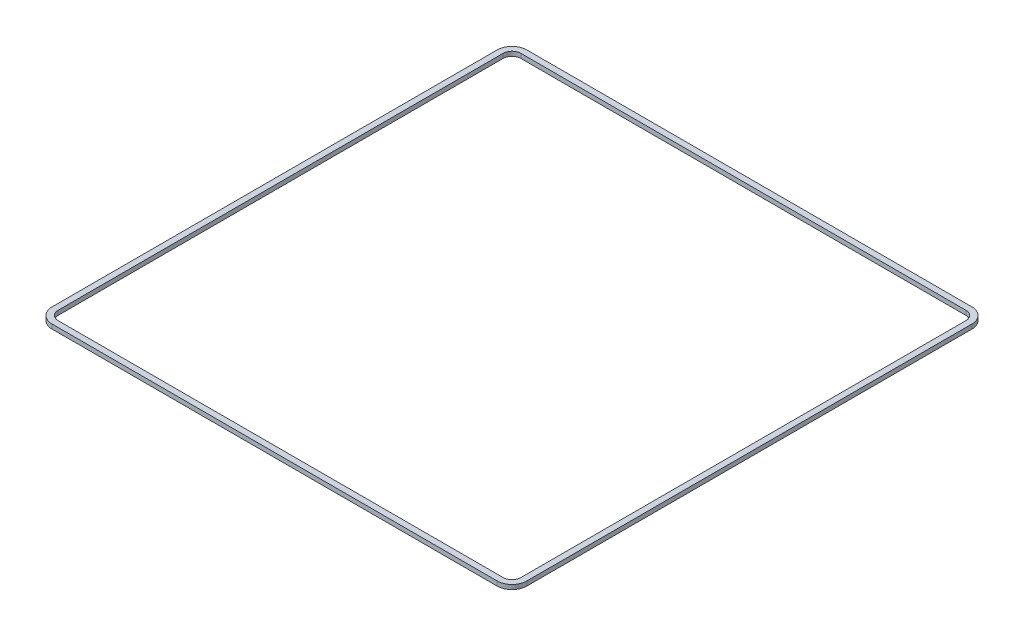
ISO-10303-21;
HEADER;
FILE_DESCRIPTION(('STEP AP214'),'2;1');
FILE_NAME('part.step','',(''),(''),'','','');
FILE_SCHEMA(('AUTOMOTIVE_DESIGN { 1 0 10303 214 1 1 1 1 }'));
ENDSEC;
DATA;
#1=APPLICATION_CONTEXT('core data for automotive mechanical design processes');
#2=APPLICATION_PROTOCOL_DEFINITION('international standard','automotive_design',2000,#1);
#3=PRODUCT_CONTEXT('',#1,'mechanical');
#4=PRODUCT('Part','Part','',(#3));
#5=PRODUCT_RELATED_PRODUCT_CATEGORY('part','',(#4));
#6=PRODUCT_DEFINITION_FORMATION('','',#4);
#7=PRODUCT_DEFINITION_CONTEXT('part definition',#1,'design');
#8=PRODUCT_DEFINITION('design','',#6,#7);
#9=PRODUCT_DEFINITION_SHAPE('','',#8);
#10=(LENGTH_UNIT() NAMED_UNIT(*) SI_UNIT(.MILLI.,.METRE.));
#11=(NAMED_UNIT(*) PLANE_ANGLE_UNIT() SI_UNIT($,.RADIAN.));
#12=(NAMED_UNIT(*) SI_UNIT($,.STERADIAN.) SOLID_ANGLE_UNIT());
#13=UNCERTAINTY_MEASURE_WITH_UNIT(LENGTH_MEASURE(1.E-05),#10,'distance_accuracy_value','');
#14=(GEOMETRIC_REPRESENTATION_CONTEXT(3) GLOBAL_UNCERTAINTY_ASSIGNED_CONTEXT((#13)) GLOBAL_UNIT_ASSIGNED_CONTEXT((#10,
#11,#12)) REPRESENTATION_CONTEXT('',''));
#15=CARTESIAN_POINT('',(0.,0.,0.));
#16=DIRECTION('',(0.,0.,1.));
#17=DIRECTION('',(1.,0.,0.));
#18=AXIS2_PLACEMENT_3D('',#15,#16,#17);
#19=CARTESIAN_POINT('',(0.,3.,0.));
#20=DIRECTION('',(0.,1.,0.));
#21=DIRECTION('',(0.,0.,1.));
#22=AXIS2_PLACEMENT_3D('',#19,#20,#21);
#23=PLANE('',#22);
#24=DIRECTION('',(0.,0.,1.));
#25=VECTOR('',#24,1.);
#26=CARTESIAN_POINT('',(205.2,3.,0.));
#27=LINE('',#26,#25);
#28=CARTESIAN_POINT('',(205.2,3.,-93.57));
#29=VERTEX_POINT('',#28);
#30=CARTESIAN_POINT('',(205.2,3.,206.43));
#31=VERTEX_POINT('',#30);
#32=EDGE_CURVE('E194',#29,#31,#27,.T.);
#33=ORIENTED_EDGE('',*,*,#32,.F.);
#34=CARTESIAN_POINT('',(195.2,3.,-93.57));
#35=DIRECTION('',(0.,1.,0.));
#36=DIRECTION('',(0.,0.,1.));
#37=AXIS2_PLACEMENT_3D('',#34,#35,#36);
#38=CIRCLE('',#37,10.);
#39=CARTESIAN_POINT('',(195.2,3.,-103.57));
#40=VERTEX_POINT('',#39);
#41=EDGE_CURVE('E241',#29,#40,#38,.T.);
#42=ORIENTED_EDGE('',*,*,#41,.T.);
#43=DIRECTION('',(1.,0.,0.));
#44=VECTOR('',#43,1.);
#45=CARTESIAN_POINT('',(0.,3.,-103.57));
#46=LINE('',#45,#44);
#47=CARTESIAN_POINT('',(-104.8,3.,-103.57));
#48=VERTEX_POINT('',#47);
#49=EDGE_CURVE('E197',#48,#40,#46,.T.);
#50=ORIENTED_EDGE('',*,*,#49,.F.);
#51=CARTESIAN_POINT('',(-104.8,3.,-93.57));
#52=DIRECTION('',(0.,1.,0.));
#53=DIRECTION('',(0.,0.,1.));
#54=AXIS2_PLACEMENT_3D('',#51,#52,#53);
#55=CIRCLE('',#54,10.);
#56=CARTESIAN_POINT('',(-114.8,3.,-93.57));
#57=VERTEX_POINT('',#56);
#58=EDGE_CURVE('E239',#48,#57,#55,.T.);
#59=ORIENTED_EDGE('',*,*,#58,.T.);
#60=DIRECTION('',(0.,0.,1.));
#61=VECTOR('',#60,1.);
#62=CARTESIAN_POINT('',(-114.8,3.,0.));
#63=LINE('',#62,#61);
#64=CARTESIAN_POINT('',(-114.8,3.,206.43));
#65=VERTEX_POINT('',#64);
#66=EDGE_CURVE('E201',#57,#65,#63,.T.);
#67=ORIENTED_EDGE('',*,*,#66,.T.);
#68=CARTESIAN_POINT('',(-104.8,3.,206.43));
#69=DIRECTION('',(0.,1.,0.));
#70=DIRECTION('',(0.,0.,1.));
#71=AXIS2_PLACEMENT_3D('',#68,#69,#70);
#72=CIRCLE('',#71,10.);
#73=CARTESIAN_POINT('',(-104.8,3.,216.43));
#74=VERTEX_POINT('',#73);
#75=EDGE_CURVE('E235',#65,#74,#72,.T.);
#76=ORIENTED_EDGE('',*,*,#75,.T.);
#77=DIRECTION('',(1.,0.,0.));
#78=VECTOR('',#77,1.);
#79=CARTESIAN_POINT('',(0.,3.,216.43));
#80=LINE('',#79,#78);
#81=CARTESIAN_POINT('',(195.2,3.,216.43));
#82=VERTEX_POINT('',#81);
#83=EDGE_CURVE('E204',#74,#82,#80,.T.);
#84=ORIENTED_EDGE('',*,*,#83,.T.);
#85=CARTESIAN_POINT('',(195.2,3.,206.43));
#86=DIRECTION('',(0.,1.,0.));
#87=DIRECTION('',(0.,0.,1.));
#88=AXIS2_PLACEMENT_3D('',#85,#86,#87);
#89=CIRCLE('',#88,10.);
#90=EDGE_CURVE('E237',#82,#31,#89,.T.);
#91=ORIENTED_EDGE('',*,*,#90,.T.);
#92=EDGE_LOOP('',(#33,#42,#50,#59,#67,#76,#84,#91));
#93=FACE_BOUND('',#92,.T.);
#94=CARTESIAN_POINT('',(-104.8,3.,-93.57));
#95=DIRECTION('',(0.,1.,0.));
#96=DIRECTION('',(0.,0.,1.));
#97=AXIS2_PLACEMENT_3D('',#94,#95,#96);
#98=CIRCLE('',#97,5.99999999999999);
#99=CARTESIAN_POINT('',(-104.8,3.,-99.57));
#100=VERTEX_POINT('',#99);
#101=CARTESIAN_POINT('',(-110.8,3.,-93.57));
#102=VERTEX_POINT('',#101);
#103=EDGE_CURVE('E158',#100,#102,#98,.T.);
#104=ORIENTED_EDGE('',*,*,#103,.F.);
#105=DIRECTION('',(1.,0.,0.));
#106=VECTOR('',#105,1.);
#107=CARTESIAN_POINT('',(0.,3.,-99.57));
#108=LINE('',#107,#106);
#109=CARTESIAN_POINT('',(195.2,3.,-99.57));
#110=VERTEX_POINT('',#109);
#111=EDGE_CURVE('E49',#100,#110,#108,.T.);
#112=ORIENTED_EDGE('',*,*,#111,.T.);
#113=CARTESIAN_POINT('',(195.2,3.,-93.57));
#114=DIRECTION('',(0.,1.,0.));
#115=DIRECTION('',(0.,0.,1.));
#116=AXIS2_PLACEMENT_3D('',#113,#114,#115);
#117=CIRCLE('',#116,5.99999999999999);
#118=CARTESIAN_POINT('',(201.2,3.,-93.57));
#119=VERTEX_POINT('',#118);
#120=EDGE_CURVE('E178',#119,#110,#117,.T.);
#121=ORIENTED_EDGE('',*,*,#120,.F.);
#122=DIRECTION('',(0.,0.,1.));
#123=VECTOR('',#122,1.);
#124=CARTESIAN_POINT('',(201.2,3.,0.));
#125=LINE('',#124,#123);
#126=CARTESIAN_POINT('',(201.2,3.,206.43));
#127=VERTEX_POINT('',#126);
#128=EDGE_CURVE('E175',#119,#127,#125,.T.);
#129=ORIENTED_EDGE('',*,*,#128,.T.);
#130=CARTESIAN_POINT('',(195.2,3.,206.43));
#131=DIRECTION('',(0.,1.,0.));
#132=DIRECTION('',(0.,0.,1.));
#133=AXIS2_PLACEMENT_3D('',#130,#131,#132);
#134=CIRCLE('',#133,5.99999999999998);
#135=CARTESIAN_POINT('',(195.2,3.,212.43));
#136=VERTEX_POINT('',#135);
#137=EDGE_CURVE('E172',#136,#127,#134,.T.);
#138=ORIENTED_EDGE('',*,*,#137,.F.);
#139=DIRECTION('',(1.,0.,0.));
#140=VECTOR('',#139,1.);
#141=CARTESIAN_POINT('',(0.,3.,212.43));
#142=LINE('',#141,#140);
#143=CARTESIAN_POINT('',(-104.8,3.,212.43));
#144=VERTEX_POINT('',#143);
#145=EDGE_CURVE('E166',#144,#136,#142,.T.);
#146=ORIENTED_EDGE('',*,*,#145,.F.);
#147=CARTESIAN_POINT('',(-104.8,3.,206.43));
#148=DIRECTION('',(0.,1.,0.));
#149=DIRECTION('',(0.,0.,1.));
#150=AXIS2_PLACEMENT_3D('',#147,#148,#149);
#151=CIRCLE('',#150,6.00000000000001);
#152=CARTESIAN_POINT('',(-110.8,3.,206.43));
#153=VERTEX_POINT('',#152);
#154=EDGE_CURVE('E164',#153,#144,#151,.T.);
#155=ORIENTED_EDGE('',*,*,#154,.F.);
#156=DIRECTION('',(0.,0.,1.));
#157=VECTOR('',#156,1.);
#158=CARTESIAN_POINT('',(-110.8,3.,0.));
#159=LINE('',#158,#157);
#160=EDGE_CURVE('E149',#102,#153,#159,.T.);
#161=ORIENTED_EDGE('',*,*,#160,.F.);
#162=EDGE_LOOP('',(#104,#112,#121,#129,#138,#146,#155,#161));
#163=FACE_BOUND('',#162,.T.);
#164=ADVANCED_FACE('F34',(#93,#163),#23,.T.);
#165=CARTESIAN_POINT('',(0.,0.,0.));
#166=DIRECTION('',(0.,1.,0.));
#167=DIRECTION('',(0.,0.,1.));
#168=AXIS2_PLACEMENT_3D('',#165,#166,#167);
#169=PLANE('',#168);
#170=DIRECTION('',(1.,0.,0.));
#171=VECTOR('',#170,1.);
#172=CARTESIAN_POINT('',(0.,0.,-103.57));
#173=LINE('',#172,#171);
#174=CARTESIAN_POINT('',(-104.8,0.,-103.57));
#175=VERTEX_POINT('',#174);
#176=CARTESIAN_POINT('',(195.2,0.,-103.57));
#177=VERTEX_POINT('',#176);
#178=EDGE_CURVE('E210',#175,#177,#173,.T.);
#179=ORIENTED_EDGE('',*,*,#178,.T.);
#180=CARTESIAN_POINT('',(195.2,0.,-93.57));
#181=DIRECTION('',(0.,1.,0.));
#182=DIRECTION('',(0.,0.,1.));
#183=AXIS2_PLACEMENT_3D('',#180,#181,#182);
#184=CIRCLE('',#183,10.);
#185=CARTESIAN_POINT('',(205.2,0.,-93.57));
#186=VERTEX_POINT('',#185);
#187=EDGE_CURVE('E228',#177,#186,#184,.F.);
#188=ORIENTED_EDGE('',*,*,#187,.T.);
#189=DIRECTION('',(0.,0.,1.));
#190=VECTOR('',#189,1.);
#191=CARTESIAN_POINT('',(205.2,0.,0.));
#192=LINE('',#191,#190);
#193=CARTESIAN_POINT('',(205.2,0.,206.43));
#194=VERTEX_POINT('',#193);
#195=EDGE_CURVE('E183',#186,#194,#192,.T.);
#196=ORIENTED_EDGE('',*,*,#195,.T.);
#197=CARTESIAN_POINT('',(195.2,0.,206.43));
#198=DIRECTION('',(0.,1.,0.));
#199=DIRECTION('',(0.,0.,1.));
#200=AXIS2_PLACEMENT_3D('',#197,#198,#199);
#201=CIRCLE('',#200,10.);
#202=CARTESIAN_POINT('',(195.2,0.,216.43));
#203=VERTEX_POINT('',#202);
#204=EDGE_CURVE('E224',#194,#203,#201,.F.);
#205=ORIENTED_EDGE('',*,*,#204,.T.);
#206=DIRECTION('',(1.,0.,0.));
#207=VECTOR('',#206,1.);
#208=CARTESIAN_POINT('',(0.,0.,216.43));
#209=LINE('',#208,#207);
#210=CARTESIAN_POINT('',(-104.8,0.,216.43));
#211=VERTEX_POINT('',#210);
#212=EDGE_CURVE('E198',#211,#203,#209,.T.);
#213=ORIENTED_EDGE('',*,*,#212,.F.);
#214=CARTESIAN_POINT('',(-104.8,0.,206.43));
#215=DIRECTION('',(0.,1.,0.));
#216=DIRECTION('',(0.,0.,1.));
#217=AXIS2_PLACEMENT_3D('',#214,#215,#216);
#218=CIRCLE('',#217,10.);
#219=CARTESIAN_POINT('',(-114.8,0.,206.43));
#220=VERTEX_POINT('',#219);
#221=EDGE_CURVE('E222',#211,#220,#218,.F.);
#222=ORIENTED_EDGE('',*,*,#221,.T.);
#223=DIRECTION('',(0.,0.,1.));
#224=VECTOR('',#223,1.);
#225=CARTESIAN_POINT('',(-114.8,0.,0.));
#226=LINE('',#225,#224);
#227=CARTESIAN_POINT('',(-114.8,0.,-93.57));
#228=VERTEX_POINT('',#227);
#229=EDGE_CURVE('E213',#228,#220,#226,.T.);
#230=ORIENTED_EDGE('',*,*,#229,.F.);
#231=CARTESIAN_POINT('',(-104.8,0.,-93.57));
#232=DIRECTION('',(0.,1.,0.));
#233=DIRECTION('',(0.,0.,1.));
#234=AXIS2_PLACEMENT_3D('',#231,#232,#233);
#235=CIRCLE('',#234,10.);
#236=EDGE_CURVE('E226',#228,#175,#235,.F.);
#237=ORIENTED_EDGE('',*,*,#236,.T.);
#238=EDGE_LOOP('',(#179,#188,#196,#205,#213,#222,#230,#237));
#239=FACE_BOUND('',#238,.T.);
#240=DIRECTION('',(1.,0.,0.));
#241=VECTOR('',#240,1.);
#242=CARTESIAN_POINT('',(0.,0.,-99.57));
#243=LINE('',#242,#241);
#244=CARTESIAN_POINT('',(-104.8,0.,-99.57));
#245=VERTEX_POINT('',#244);
#246=CARTESIAN_POINT('',(195.2,0.,-99.57));
#247=VERTEX_POINT('',#246);
#248=EDGE_CURVE('E11',#245,#247,#243,.T.);
#249=ORIENTED_EDGE('',*,*,#248,.F.);
#250=CARTESIAN_POINT('',(-104.8,0.,-93.57));
#251=DIRECTION('',(0.,1.,0.));
#252=DIRECTION('',(0.,0.,1.));
#253=AXIS2_PLACEMENT_3D('',#250,#251,#252);
#254=CIRCLE('',#253,5.99999999999999);
#255=CARTESIAN_POINT('',(-110.8,0.,-93.57));
#256=VERTEX_POINT('',#255);
#257=EDGE_CURVE('E253',#245,#256,#254,.T.);
#258=ORIENTED_EDGE('',*,*,#257,.T.);
#259=DIRECTION('',(0.,0.,1.));
#260=VECTOR('',#259,1.);
#261=CARTESIAN_POINT('',(-110.8,0.,0.));
#262=LINE('',#261,#260);
#263=CARTESIAN_POINT('',(-110.8,0.,206.43));
#264=VERTEX_POINT('',#263);
#265=EDGE_CURVE('E152',#256,#264,#262,.T.);
#266=ORIENTED_EDGE('',*,*,#265,.T.);
#267=CARTESIAN_POINT('',(-104.8,0.,206.43));
#268=DIRECTION('',(0.,1.,0.));
#269=DIRECTION('',(0.,0.,1.));
#270=AXIS2_PLACEMENT_3D('',#267,#268,#269);
#271=CIRCLE('',#270,6.00000000000001);
#272=CARTESIAN_POINT('',(-104.8,0.,212.43));
#273=VERTEX_POINT('',#272);
#274=EDGE_CURVE('E256',#264,#273,#271,.T.);
#275=ORIENTED_EDGE('',*,*,#274,.T.);
#276=DIRECTION('',(1.,0.,0.));
#277=VECTOR('',#276,1.);
#278=CARTESIAN_POINT('',(0.,0.,212.43));
#279=LINE('',#278,#277);
#280=CARTESIAN_POINT('',(195.2,0.,212.43));
#281=VERTEX_POINT('',#280);
#282=EDGE_CURVE('E259',#273,#281,#279,.T.);
#283=ORIENTED_EDGE('',*,*,#282,.T.);
#284=CARTESIAN_POINT('',(195.2,0.,206.43));
#285=DIRECTION('',(0.,1.,0.));
#286=DIRECTION('',(0.,0.,1.));
#287=AXIS2_PLACEMENT_3D('',#284,#285,#286);
#288=CIRCLE('',#287,5.99999999999998);
#289=CARTESIAN_POINT('',(201.2,0.,206.43));
#290=VERTEX_POINT('',#289);
#291=EDGE_CURVE('E262',#281,#290,#288,.T.);
#292=ORIENTED_EDGE('',*,*,#291,.T.);
#293=DIRECTION('',(0.,0.,1.));
#294=VECTOR('',#293,1.);
#295=CARTESIAN_POINT('',(201.2,0.,0.));
#296=LINE('',#295,#294);
#297=CARTESIAN_POINT('',(201.2,0.,-93.57));
#298=VERTEX_POINT('',#297);
#299=EDGE_CURVE('E265',#298,#290,#296,.T.);
#300=ORIENTED_EDGE('',*,*,#299,.F.);
#301=CARTESIAN_POINT('',(195.2,0.,-93.57));
#302=DIRECTION('',(0.,1.,0.));
#303=DIRECTION('',(0.,0.,1.));
#304=AXIS2_PLACEMENT_3D('',#301,#302,#303);
#305=CIRCLE('',#304,5.99999999999999);
#306=EDGE_CURVE('E42',#298,#247,#305,.T.);
#307=ORIENTED_EDGE('',*,*,#306,.T.);
#308=EDGE_LOOP('',(#249,#258,#266,#275,#283,#292,#300,#307));
#309=FACE_BOUND('',#308,.T.);
#310=ADVANCED_FACE('F270',(#239,#309),#169,.F.);
#311=CARTESIAN_POINT('',(205.2,3.,0.));
#312=DIRECTION('',(1.,0.,0.));
#313=DIRECTION('',(0.,0.,-1.));
#314=AXIS2_PLACEMENT_3D('',#311,#312,#313);
#315=PLANE('',#314);
#316=ORIENTED_EDGE('',*,*,#195,.F.);
#317=DIRECTION('',(0.,-1.,0.));
#318=VECTOR('',#317,1.);
#319=CARTESIAN_POINT('',(205.2,3.,-93.57));
#320=LINE('',#319,#318);
#321=EDGE_CURVE('E233',#186,#29,#320,.F.);
#322=ORIENTED_EDGE('',*,*,#321,.T.);
#323=ORIENTED_EDGE('',*,*,#32,.T.);
#324=DIRECTION('',(0.,-1.,0.));
#325=VECTOR('',#324,1.);
#326=CARTESIAN_POINT('',(205.2,0.,206.43));
#327=LINE('',#326,#325);
#328=EDGE_CURVE('E230',#31,#194,#327,.T.);
#329=ORIENTED_EDGE('',*,*,#328,.T.);
#330=EDGE_LOOP('',(#316,#322,#323,#329));
#331=FACE_BOUND('',#330,.T.);
#332=ADVANCED_FACE('F306',(#331),#315,.T.);
#333=CARTESIAN_POINT('',(0.,3.,-103.57));
#334=DIRECTION('',(0.,0.,-1.));
#335=DIRECTION('',(-1.,0.,0.));
#336=AXIS2_PLACEMENT_3D('',#333,#334,#335);
#337=PLANE('',#336);
#338=ORIENTED_EDGE('',*,*,#49,.T.);
#339=DIRECTION('',(0.,-1.,0.));
#340=VECTOR('',#339,1.);
#341=CARTESIAN_POINT('',(195.2,3.,-103.57));
#342=LINE('',#341,#340);
#343=EDGE_CURVE('E219',#40,#177,#342,.T.);
#344=ORIENTED_EDGE('',*,*,#343,.T.);
#345=ORIENTED_EDGE('',*,*,#178,.F.);
#346=DIRECTION('',(0.,-1.,0.));
#347=VECTOR('',#346,1.);
#348=CARTESIAN_POINT('',(-104.8,3.,-103.57));
#349=LINE('',#348,#347);
#350=EDGE_CURVE('E207',#175,#48,#349,.F.);
#351=ORIENTED_EDGE('',*,*,#350,.T.);
#352=EDGE_LOOP('',(#338,#344,#345,#351));
#353=FACE_BOUND('',#352,.T.);
#354=ADVANCED_FACE('F319',(#353),#337,.T.);
#355=CARTESIAN_POINT('',(-114.8,3.,0.));
#356=DIRECTION('',(1.,0.,0.));
#357=DIRECTION('',(0.,0.,-1.));
#358=AXIS2_PLACEMENT_3D('',#355,#356,#357);
#359=PLANE('',#358);
#360=ORIENTED_EDGE('',*,*,#66,.F.);
#361=DIRECTION('',(0.,-1.,0.));
#362=VECTOR('',#361,1.);
#363=CARTESIAN_POINT('',(-114.8,0.,-93.57));
#364=LINE('',#363,#362);
#365=EDGE_CURVE('E245',#57,#228,#364,.T.);
#366=ORIENTED_EDGE('',*,*,#365,.T.);
#367=ORIENTED_EDGE('',*,*,#229,.T.);
#368=DIRECTION('',(0.,-1.,0.));
#369=VECTOR('',#368,1.);
#370=CARTESIAN_POINT('',(-114.8,3.,206.43));
#371=LINE('',#370,#369);
#372=EDGE_CURVE('E243',#220,#65,#371,.F.);
#373=ORIENTED_EDGE('',*,*,#372,.T.);
#374=EDGE_LOOP('',(#360,#366,#367,#373));
#375=FACE_BOUND('',#374,.T.);
#376=ADVANCED_FACE('F315',(#375),#359,.F.);
#377=CARTESIAN_POINT('',(0.,3.,216.43));
#378=DIRECTION('',(0.,0.,-1.));
#379=DIRECTION('',(-1.,0.,0.));
#380=AXIS2_PLACEMENT_3D('',#377,#378,#379);
#381=PLANE('',#380);
#382=ORIENTED_EDGE('',*,*,#212,.T.);
#383=DIRECTION('',(0.,-1.,0.));
#384=VECTOR('',#383,1.);
#385=CARTESIAN_POINT('',(195.2,3.,216.43));
#386=LINE('',#385,#384);
#387=EDGE_CURVE('E251',#203,#82,#386,.F.);
#388=ORIENTED_EDGE('',*,*,#387,.T.);
#389=ORIENTED_EDGE('',*,*,#83,.F.);
#390=DIRECTION('',(0.,-1.,0.));
#391=VECTOR('',#390,1.);
#392=CARTESIAN_POINT('',(-104.8,3.,216.43));
#393=LINE('',#392,#391);
#394=EDGE_CURVE('E248',#74,#211,#393,.T.);
#395=ORIENTED_EDGE('',*,*,#394,.T.);
#396=EDGE_LOOP('',(#382,#388,#389,#395));
#397=FACE_BOUND('',#396,.T.);
#398=ADVANCED_FACE('F311',(#397),#381,.F.);
#399=CARTESIAN_POINT('',(195.2,3.,-93.57));
#400=DIRECTION('',(0.,-1.,0.));
#401=DIRECTION('',(0.,0.,-1.));
#402=AXIS2_PLACEMENT_3D('',#399,#400,#401);
#403=CYLINDRICAL_SURFACE('',#402,10.);
#404=ORIENTED_EDGE('',*,*,#41,.F.);
#405=ORIENTED_EDGE('',*,*,#321,.F.);
#406=ORIENTED_EDGE('',*,*,#187,.F.);
#407=ORIENTED_EDGE('',*,*,#343,.F.);
#408=EDGE_LOOP('',(#404,#405,#406,#407));
#409=FACE_BOUND('',#408,.T.);
#410=ADVANCED_FACE('F314',(#409),#403,.T.);
#411=CARTESIAN_POINT('',(-104.8,3.,-93.57));
#412=DIRECTION('',(0.,1.,0.));
#413=DIRECTION('',(0.,0.,1.));
#414=AXIS2_PLACEMENT_3D('',#411,#412,#413);
#415=CYLINDRICAL_SURFACE('',#414,10.);
#416=ORIENTED_EDGE('',*,*,#58,.F.);
#417=ORIENTED_EDGE('',*,*,#350,.F.);
#418=ORIENTED_EDGE('',*,*,#236,.F.);
#419=ORIENTED_EDGE('',*,*,#365,.F.);
#420=EDGE_LOOP('',(#416,#417,#418,#419));
#421=FACE_BOUND('',#420,.T.);
#422=ADVANCED_FACE('F329',(#421),#415,.T.);
#423=CARTESIAN_POINT('',(195.2,3.,206.43));
#424=DIRECTION('',(0.,1.,0.));
#425=DIRECTION('',(0.,0.,1.));
#426=AXIS2_PLACEMENT_3D('',#423,#424,#425);
#427=CYLINDRICAL_SURFACE('',#426,10.);
#428=ORIENTED_EDGE('',*,*,#90,.F.);
#429=ORIENTED_EDGE('',*,*,#387,.F.);
#430=ORIENTED_EDGE('',*,*,#204,.F.);
#431=ORIENTED_EDGE('',*,*,#328,.F.);
#432=EDGE_LOOP('',(#428,#429,#430,#431));
#433=FACE_BOUND('',#432,.T.);
#434=ADVANCED_FACE('F297',(#433),#427,.T.);
#435=CARTESIAN_POINT('',(-104.8,3.,206.43));
#436=DIRECTION('',(0.,-1.,0.));
#437=DIRECTION('',(0.,0.,-1.));
#438=AXIS2_PLACEMENT_3D('',#435,#436,#437);
#439=CYLINDRICAL_SURFACE('',#438,10.);
#440=ORIENTED_EDGE('',*,*,#75,.F.);
#441=ORIENTED_EDGE('',*,*,#372,.F.);
#442=ORIENTED_EDGE('',*,*,#221,.F.);
#443=ORIENTED_EDGE('',*,*,#394,.F.);
#444=EDGE_LOOP('',(#440,#441,#442,#443));
#445=FACE_BOUND('',#444,.T.);
#446=ADVANCED_FACE('F36',(#445),#439,.T.);
#447=CARTESIAN_POINT('',(0.,-7.,-99.57));
#448=DIRECTION('',(0.,0.,1.));
#449=DIRECTION('',(1.,0.,0.));
#450=AXIS2_PLACEMENT_3D('',#447,#448,#449);
#451=PLANE('',#450);
#452=ORIENTED_EDGE('',*,*,#248,.T.);
#453=DIRECTION('',(0.,1.,0.));
#454=VECTOR('',#453,1.);
#455=CARTESIAN_POINT('',(195.2,-7.,-99.57));
#456=LINE('',#455,#454);
#457=EDGE_CURVE('E181',#247,#110,#456,.T.);
#458=ORIENTED_EDGE('',*,*,#457,.T.);
#459=ORIENTED_EDGE('',*,*,#111,.F.);
#460=DIRECTION('',(0.,1.,0.));
#461=VECTOR('',#460,1.);
#462=CARTESIAN_POINT('',(-104.8,-7.,-99.57));
#463=LINE('',#462,#461);
#464=EDGE_CURVE('E155',#245,#100,#463,.T.);
#465=ORIENTED_EDGE('',*,*,#464,.F.);
#466=EDGE_LOOP('',(#452,#458,#459,#465));
#467=FACE_BOUND('',#466,.T.);
#468=ADVANCED_FACE('F289',(#467),#451,.T.);
#469=CARTESIAN_POINT('',(195.2,-7.,-93.57));
#470=DIRECTION('',(0.,1.,0.));
#471=DIRECTION('',(0.,0.,1.));
#472=AXIS2_PLACEMENT_3D('',#469,#470,#471);
#473=CYLINDRICAL_SURFACE('',#472,5.99999999999999);
#474=DIRECTION('',(0.,1.,0.));
#475=VECTOR('',#474,1.);
#476=CARTESIAN_POINT('',(201.2,-7.,-93.57));
#477=LINE('',#476,#475);
#478=EDGE_CURVE('E184',#298,#119,#477,.T.);
#479=ORIENTED_EDGE('',*,*,#478,.T.);
#480=ORIENTED_EDGE('',*,*,#120,.T.);
#481=ORIENTED_EDGE('',*,*,#457,.F.);
#482=ORIENTED_EDGE('',*,*,#306,.F.);
#483=EDGE_LOOP('',(#479,#480,#481,#482));
#484=FACE_BOUND('',#483,.T.);
#485=ADVANCED_FACE('F274',(#484),#473,.F.);
#486=CARTESIAN_POINT('',(201.2,-7.,0.));
#487=DIRECTION('',(-1.,0.,0.));
#488=DIRECTION('',(0.,0.,1.));
#489=AXIS2_PLACEMENT_3D('',#486,#487,#488);
#490=PLANE('',#489);
#491=ORIENTED_EDGE('',*,*,#299,.T.);
#492=DIRECTION('',(0.,1.,0.));
#493=VECTOR('',#492,1.);
#494=CARTESIAN_POINT('',(201.2,-7.,206.43));
#495=LINE('',#494,#493);
#496=EDGE_CURVE('E186',#290,#127,#495,.T.);
#497=ORIENTED_EDGE('',*,*,#496,.T.);
#498=ORIENTED_EDGE('',*,*,#128,.F.);
#499=ORIENTED_EDGE('',*,*,#478,.F.);
#500=EDGE_LOOP('',(#491,#497,#498,#499));
#501=FACE_BOUND('',#500,.T.);
#502=ADVANCED_FACE('F277',(#501),#490,.T.);
#503=CARTESIAN_POINT('',(195.2,-7.,206.43));
#504=DIRECTION('',(0.,1.,0.));
#505=DIRECTION('',(0.,0.,1.));
#506=AXIS2_PLACEMENT_3D('',#503,#504,#505);
#507=CYLINDRICAL_SURFACE('',#506,5.99999999999998);
#508=DIRECTION('',(0.,1.,0.));
#509=VECTOR('',#508,1.);
#510=CARTESIAN_POINT('',(195.2,-7.,212.43));
#511=LINE('',#510,#509);
#512=EDGE_CURVE('E188',#281,#136,#511,.T.);
#513=ORIENTED_EDGE('',*,*,#512,.T.);
#514=ORIENTED_EDGE('',*,*,#137,.T.);
#515=ORIENTED_EDGE('',*,*,#496,.F.);
#516=ORIENTED_EDGE('',*,*,#291,.F.);
#517=EDGE_LOOP('',(#513,#514,#515,#516));
#518=FACE_BOUND('',#517,.T.);
#519=ADVANCED_FACE('F282',(#518),#507,.F.);
#520=CARTESIAN_POINT('',(0.,-7.,212.43));
#521=DIRECTION('',(0.,0.,1.));
#522=DIRECTION('',(1.,0.,0.));
#523=AXIS2_PLACEMENT_3D('',#520,#521,#522);
#524=PLANE('',#523);
#525=DIRECTION('',(0.,1.,0.));
#526=VECTOR('',#525,1.);
#527=CARTESIAN_POINT('',(-104.8,-7.,212.43));
#528=LINE('',#527,#526);
#529=EDGE_CURVE('E190',#273,#144,#528,.T.);
#530=ORIENTED_EDGE('',*,*,#529,.T.);
#531=ORIENTED_EDGE('',*,*,#145,.T.);
#532=ORIENTED_EDGE('',*,*,#512,.F.);
#533=ORIENTED_EDGE('',*,*,#282,.F.);
#534=EDGE_LOOP('',(#530,#531,#532,#533));
#535=FACE_BOUND('',#534,.T.);
#536=ADVANCED_FACE('F285',(#535),#524,.F.);
#537=CARTESIAN_POINT('',(-104.8,-7.,206.43));
#538=DIRECTION('',(0.,1.,0.));
#539=DIRECTION('',(0.,0.,1.));
#540=AXIS2_PLACEMENT_3D('',#537,#538,#539);
#541=CYLINDRICAL_SURFACE('',#540,6.00000000000001);
#542=DIRECTION('',(0.,1.,0.));
#543=VECTOR('',#542,1.);
#544=CARTESIAN_POINT('',(-110.8,-7.,206.43));
#545=LINE('',#544,#543);
#546=EDGE_CURVE('E154',#264,#153,#545,.T.);
#547=ORIENTED_EDGE('',*,*,#546,.T.);
#548=ORIENTED_EDGE('',*,*,#154,.T.);
#549=ORIENTED_EDGE('',*,*,#529,.F.);
#550=ORIENTED_EDGE('',*,*,#274,.F.);
#551=EDGE_LOOP('',(#547,#548,#549,#550));
#552=FACE_BOUND('',#551,.T.);
#553=ADVANCED_FACE('F288',(#552),#541,.F.);
#554=CARTESIAN_POINT('',(-110.8,-7.,0.));
#555=DIRECTION('',(-1.,0.,0.));
#556=DIRECTION('',(0.,0.,1.));
#557=AXIS2_PLACEMENT_3D('',#554,#555,#556);
#558=PLANE('',#557);
#559=DIRECTION('',(0.,1.,0.));
#560=VECTOR('',#559,1.);
#561=CARTESIAN_POINT('',(-110.8,-7.,-93.57));
#562=LINE('',#561,#560);
#563=EDGE_CURVE('E57',#256,#102,#562,.T.);
#564=ORIENTED_EDGE('',*,*,#563,.T.);
#565=ORIENTED_EDGE('',*,*,#160,.T.);
#566=ORIENTED_EDGE('',*,*,#546,.F.);
#567=ORIENTED_EDGE('',*,*,#265,.F.);
#568=EDGE_LOOP('',(#564,#565,#566,#567));
#569=FACE_BOUND('',#568,.T.);
#570=ADVANCED_FACE('F146',(#569),#558,.F.);
#571=CARTESIAN_POINT('',(-104.8,-7.,-93.57));
#572=DIRECTION('',(0.,1.,0.));
#573=DIRECTION('',(0.,0.,1.));
#574=AXIS2_PLACEMENT_3D('',#571,#572,#573);
#575=CYLINDRICAL_SURFACE('',#574,5.99999999999999);
#576=ORIENTED_EDGE('',*,*,#464,.T.);
#577=ORIENTED_EDGE('',*,*,#103,.T.);
#578=ORIENTED_EDGE('',*,*,#563,.F.);
#579=ORIENTED_EDGE('',*,*,#257,.F.);
#580=EDGE_LOOP('',(#576,#577,#578,#579));
#581=FACE_BOUND('',#580,.T.);
#582=ADVANCED_FACE('F159',(#581),#575,.F.);
#583=CLOSED_SHELL('',(#164,#310,#332,#354,#376,#398,#410,#422,#434,#446,#468,#485,#502,#519,
#536,#553,#570,#582));
#584=MANIFOLD_SOLID_BREP('B2',#583);
#585=ADVANCED_BREP_SHAPE_REPRESENTATION('',(#18,#584),#14);
#586=SHAPE_DEFINITION_REPRESENTATION(#9,#585);
ENDSEC;
END-ISO-10303-21;
